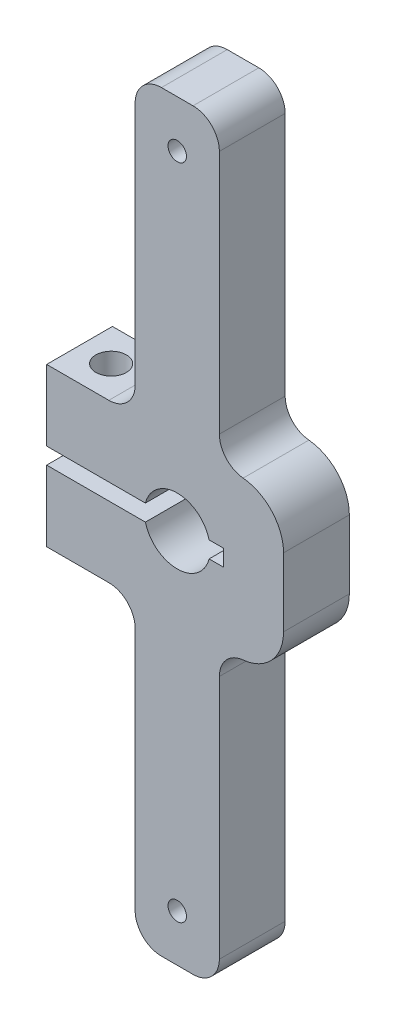
ISO-10303-21;
HEADER;
FILE_DESCRIPTION(('STEP AP214'),'2;1');
FILE_NAME('part.step','',(''),(''),'','','');
FILE_SCHEMA(('AUTOMOTIVE_DESIGN { 1 0 10303 214 1 1 1 1 }'));
ENDSEC;
DATA;
#1=APPLICATION_CONTEXT('core data for automotive mechanical design processes');
#2=APPLICATION_PROTOCOL_DEFINITION('international standard','automotive_design',2000,#1);
#3=PRODUCT_CONTEXT('',#1,'mechanical');
#4=PRODUCT('Part','Part','',(#3));
#5=PRODUCT_RELATED_PRODUCT_CATEGORY('part','',(#4));
#6=PRODUCT_DEFINITION_FORMATION('','',#4);
#7=PRODUCT_DEFINITION_CONTEXT('part definition',#1,'design');
#8=PRODUCT_DEFINITION('design','',#6,#7);
#9=PRODUCT_DEFINITION_SHAPE('','',#8);
#10=(LENGTH_UNIT() NAMED_UNIT(*) SI_UNIT(.MILLI.,.METRE.));
#11=(NAMED_UNIT(*) PLANE_ANGLE_UNIT() SI_UNIT($,.RADIAN.));
#12=(NAMED_UNIT(*) SI_UNIT($,.STERADIAN.) SOLID_ANGLE_UNIT());
#13=UNCERTAINTY_MEASURE_WITH_UNIT(LENGTH_MEASURE(1.E-05),#10,'distance_accuracy_value','');
#14=(GEOMETRIC_REPRESENTATION_CONTEXT(3) GLOBAL_UNCERTAINTY_ASSIGNED_CONTEXT((#13)) GLOBAL_UNIT_ASSIGNED_CONTEXT((#10,
#11,#12)) REPRESENTATION_CONTEXT('',''));
#15=CARTESIAN_POINT('',(0.,0.,0.));
#16=DIRECTION('',(0.,0.,1.));
#17=DIRECTION('',(1.,0.,0.));
#18=AXIS2_PLACEMENT_3D('',#15,#16,#17);
#19=CARTESIAN_POINT('',(-21.4924927341236,7.62,6.35));
#20=DIRECTION('',(0.,-1.,0.));
#21=DIRECTION('',(0.,0.,-1.));
#22=AXIS2_PLACEMENT_3D('',#19,#20,#21);
#23=PLANE('',#22);
#24=CARTESIAN_POINT('',(-18.4444927341236,7.62,3.175));
#25=DIRECTION('',(0.,-1.,0.));
#26=DIRECTION('',(0.,0.,-1.));
#27=AXIS2_PLACEMENT_3D('',#24,#25,#26);
#28=CIRCLE('',#27,1.4732);
#29=CARTESIAN_POINT('',(-18.4444927341236,7.62,1.7018));
#30=VERTEX_POINT('',#29);
#31=EDGE_CURVE('E402',#30,#30,#28,.T.);
#32=ORIENTED_EDGE('',*,*,#31,.T.);
#33=EDGE_LOOP('',(#32));
#34=FACE_BOUND('',#33,.T.);
#35=DIRECTION('',(-1.,0.,0.));
#36=VECTOR('',#35,1.);
#37=CARTESIAN_POINT('',(-6.25249273412365,7.62,6.35));
#38=LINE('',#37,#36);
#39=CARTESIAN_POINT('',(-15.494,7.62,6.35));
#40=VERTEX_POINT('',#39);
#41=CARTESIAN_POINT('',(-21.4924927341236,7.62,6.35));
#42=VERTEX_POINT('',#41);
#43=EDGE_CURVE('E336',#40,#42,#38,.T.);
#44=ORIENTED_EDGE('',*,*,#43,.F.);
#45=DIRECTION('',(0.,0.,1.));
#46=VECTOR('',#45,1.);
#47=CARTESIAN_POINT('',(-15.494,7.62,0.));
#48=LINE('',#47,#46);
#49=CARTESIAN_POINT('',(-15.494,7.62,0.));
#50=VERTEX_POINT('',#49);
#51=EDGE_CURVE('E454',#40,#50,#48,.F.);
#52=ORIENTED_EDGE('',*,*,#51,.T.);
#53=DIRECTION('',(-1.,0.,0.));
#54=VECTOR('',#53,1.);
#55=CARTESIAN_POINT('',(-21.4924927341236,7.62,0.));
#56=LINE('',#55,#54);
#57=CARTESIAN_POINT('',(-21.4924927341236,7.62,0.));
#58=VERTEX_POINT('',#57);
#59=EDGE_CURVE('E326',#50,#58,#56,.T.);
#60=ORIENTED_EDGE('',*,*,#59,.T.);
#61=DIRECTION('',(0.,0.,-1.));
#62=VECTOR('',#61,1.);
#63=CARTESIAN_POINT('',(-21.4924927341236,7.62,6.35));
#64=LINE('',#63,#62);
#65=EDGE_CURVE('E289',#42,#58,#64,.T.);
#66=ORIENTED_EDGE('',*,*,#65,.F.);
#67=EDGE_LOOP('',(#44,#52,#60,#66));
#68=FACE_BOUND('',#67,.T.);
#69=ADVANCED_FACE('F44',(#34,#68),#23,.F.);
#70=CARTESIAN_POINT('',(-4.445,-0.793749999999996,0.));
#71=DIRECTION('',(0.,-1.,0.));
#72=DIRECTION('',(1.,0.,0.));
#73=AXIS2_PLACEMENT_3D('',#70,#71,#72);
#74=PLANE('',#73);
#75=DIRECTION('',(1.,0.,0.));
#76=VECTOR('',#75,1.);
#77=CARTESIAN_POINT('',(-4.445,-0.793749999999996,0.));
#78=LINE('',#77,#76);
#79=CARTESIAN_POINT('',(-5.81581946894786,-0.793749999999997,0.));
#80=VERTEX_POINT('',#79);
#81=CARTESIAN_POINT('',(-4.445,-0.793749999999996,0.));
#82=VERTEX_POINT('',#81);
#83=EDGE_CURVE('E556',#80,#82,#78,.T.);
#84=ORIENTED_EDGE('',*,*,#83,.F.);
#85=DIRECTION('',(0.,0.,1.));
#86=VECTOR('',#85,1.);
#87=CARTESIAN_POINT('',(-5.81581946894786,-0.793749999999997,0.));
#88=LINE('',#87,#86);
#89=CARTESIAN_POINT('',(-5.81581946894786,-0.793749999999997,6.35));
#90=VERTEX_POINT('',#89);
#91=EDGE_CURVE('E546',#80,#90,#88,.T.);
#92=ORIENTED_EDGE('',*,*,#91,.T.);
#93=DIRECTION('',(1.,0.,0.));
#94=VECTOR('',#93,1.);
#95=CARTESIAN_POINT('',(-4.445,-0.793749999999996,6.35));
#96=LINE('',#95,#94);
#97=CARTESIAN_POINT('',(-4.445,-0.793749999999996,6.35));
#98=VERTEX_POINT('',#97);
#99=EDGE_CURVE('E308',#90,#98,#96,.T.);
#100=ORIENTED_EDGE('',*,*,#99,.T.);
#101=DIRECTION('',(0.,0.,1.));
#102=VECTOR('',#101,1.);
#103=CARTESIAN_POINT('',(-4.445,-0.793749999999996,0.));
#104=LINE('',#103,#102);
#105=EDGE_CURVE('E322',#82,#98,#104,.T.);
#106=ORIENTED_EDGE('',*,*,#105,.F.);
#107=EDGE_LOOP('',(#84,#92,#100,#106));
#108=FACE_BOUND('',#107,.T.);
#109=ADVANCED_FACE('F569',(#108),#74,.F.);
#110=CARTESIAN_POINT('',(-4.445,0.793750000000003,0.));
#111=DIRECTION('',(0.,1.,0.));
#112=DIRECTION('',(-1.,0.,0.));
#113=AXIS2_PLACEMENT_3D('',#110,#111,#112);
#114=PLANE('',#113);
#115=CARTESIAN_POINT('',(-18.4444927341236,0.793750000000001,3.175));
#116=DIRECTION('',(0.,1.,0.));
#117=DIRECTION('',(-1.,0.,0.));
#118=AXIS2_PLACEMENT_3D('',#115,#116,#117);
#119=CIRCLE('',#118,1.47319999999999);
#120=CARTESIAN_POINT('',(-19.9176927341236,0.793750000000001,3.175));
#121=VERTEX_POINT('',#120);
#122=EDGE_CURVE('E401',#121,#121,#119,.T.);
#123=ORIENTED_EDGE('',*,*,#122,.T.);
#124=EDGE_LOOP('',(#123));
#125=FACE_BOUND('',#124,.T.);
#126=DIRECTION('',(-1.,0.,0.));
#127=VECTOR('',#126,1.);
#128=CARTESIAN_POINT('',(-4.445,0.793750000000003,0.));
#129=LINE('',#128,#127);
#130=CARTESIAN_POINT('',(-11.9641805310521,0.793750000000002,0.));
#131=VERTEX_POINT('',#130);
#132=CARTESIAN_POINT('',(-21.4924927341236,0.79375,0.));
#133=VERTEX_POINT('',#132);
#134=EDGE_CURVE('E553',#131,#133,#129,.T.);
#135=ORIENTED_EDGE('',*,*,#134,.F.);
#136=DIRECTION('',(0.,0.,1.));
#137=VECTOR('',#136,1.);
#138=CARTESIAN_POINT('',(-11.9641805310521,0.793750000000002,0.));
#139=LINE('',#138,#137);
#140=CARTESIAN_POINT('',(-11.9641805310521,0.793750000000002,6.35));
#141=VERTEX_POINT('',#140);
#142=EDGE_CURVE('E288',#131,#141,#139,.T.);
#143=ORIENTED_EDGE('',*,*,#142,.T.);
#144=DIRECTION('',(-1.,0.,0.));
#145=VECTOR('',#144,1.);
#146=CARTESIAN_POINT('',(-4.445,0.793750000000003,6.35));
#147=LINE('',#146,#145);
#148=CARTESIAN_POINT('',(-21.4924927341236,0.793750000000001,6.35));
#149=VERTEX_POINT('',#148);
#150=EDGE_CURVE('E299',#141,#149,#147,.T.);
#151=ORIENTED_EDGE('',*,*,#150,.T.);
#152=DIRECTION('',(0.,0.,1.));
#153=VECTOR('',#152,1.);
#154=CARTESIAN_POINT('',(-21.4924927341236,0.793750000000001,0.));
#155=LINE('',#154,#153);
#156=EDGE_CURVE('E330',#133,#149,#155,.T.);
#157=ORIENTED_EDGE('',*,*,#156,.F.);
#158=EDGE_LOOP('',(#135,#143,#151,#157));
#159=FACE_BOUND('',#158,.T.);
#160=ADVANCED_FACE('F577',(#125,#159),#114,.F.);
#161=CARTESIAN_POINT('',(-21.4924927341236,-7.62,6.35));
#162=DIRECTION('',(1.,0.,0.));
#163=DIRECTION('',(0.,0.,-1.));
#164=AXIS2_PLACEMENT_3D('',#161,#162,#163);
#165=PLANE('',#164);
#166=DIRECTION('',(0.,-1.,0.));
#167=VECTOR('',#166,1.);
#168=CARTESIAN_POINT('',(-21.4924927341236,-7.62,6.35));
#169=LINE('',#168,#167);
#170=CARTESIAN_POINT('',(-21.4924927341236,-0.793750000000002,6.35));
#171=VERTEX_POINT('',#170);
#172=CARTESIAN_POINT('',(-21.4924927341236,-7.62,6.35));
#173=VERTEX_POINT('',#172);
#174=EDGE_CURVE('E339',#171,#173,#169,.T.);
#175=ORIENTED_EDGE('',*,*,#174,.F.);
#176=DIRECTION('',(0.,0.,1.));
#177=VECTOR('',#176,1.);
#178=CARTESIAN_POINT('',(-21.4924927341236,-0.793750000000002,0.));
#179=LINE('',#178,#177);
#180=CARTESIAN_POINT('',(-21.4924927341236,-0.793750000000002,0.));
#181=VERTEX_POINT('',#180);
#182=EDGE_CURVE('E327',#181,#171,#179,.T.);
#183=ORIENTED_EDGE('',*,*,#182,.F.);
#184=DIRECTION('',(0.,-1.,0.));
#185=VECTOR('',#184,1.);
#186=CARTESIAN_POINT('',(-21.4924927341236,-7.62,0.));
#187=LINE('',#186,#185);
#188=CARTESIAN_POINT('',(-21.4924927341236,-7.62,0.));
#189=VERTEX_POINT('',#188);
#190=EDGE_CURVE('E355',#181,#189,#187,.T.);
#191=ORIENTED_EDGE('',*,*,#190,.T.);
#192=DIRECTION('',(0.,0.,-1.));
#193=VECTOR('',#192,1.);
#194=CARTESIAN_POINT('',(-21.4924927341236,-7.62,6.35));
#195=LINE('',#194,#193);
#196=EDGE_CURVE('E352',#173,#189,#195,.T.);
#197=ORIENTED_EDGE('',*,*,#196,.F.);
#198=EDGE_LOOP('',(#175,#183,#191,#197));
#199=FACE_BOUND('',#198,.T.);
#200=ADVANCED_FACE('F601',(#199),#165,.F.);
#201=EDGE_CURVE('E356',#58,#133,#187,.T.);
#202=ORIENTED_EDGE('',*,*,#201,.T.);
#203=ORIENTED_EDGE('',*,*,#156,.T.);
#204=EDGE_CURVE('E341',#42,#149,#169,.T.);
#205=ORIENTED_EDGE('',*,*,#204,.F.);
#206=ORIENTED_EDGE('',*,*,#65,.T.);
#207=EDGE_LOOP('',(#202,#203,#205,#206));
#208=FACE_BOUND('',#207,.T.);
#209=ADVANCED_FACE('F644',(#208),#165,.F.);
#210=CARTESIAN_POINT('',(-6.25249273412365,-7.62,6.35));
#211=DIRECTION('',(0.,1.,0.));
#212=DIRECTION('',(0.,0.,1.));
#213=AXIS2_PLACEMENT_3D('',#210,#211,#212);
#214=PLANE('',#213);
#215=CARTESIAN_POINT('',(-18.4444927341236,-7.62,3.175));
#216=DIRECTION('',(0.,-1.,0.));
#217=DIRECTION('',(0.,0.,-1.));
#218=AXIS2_PLACEMENT_3D('',#215,#216,#217);
#219=CIRCLE('',#218,1.47319999999999);
#220=CARTESIAN_POINT('',(-18.4444927341236,-7.62,1.70180000000001));
#221=VERTEX_POINT('',#220);
#222=EDGE_CURVE('E530',#221,#221,#219,.T.);
#223=ORIENTED_EDGE('',*,*,#222,.F.);
#224=EDGE_LOOP('',(#223));
#225=FACE_BOUND('',#224,.T.);
#226=DIRECTION('',(1.,0.,0.));
#227=VECTOR('',#226,1.);
#228=CARTESIAN_POINT('',(-6.25249273412365,-7.62,0.));
#229=LINE('',#228,#227);
#230=CARTESIAN_POINT('',(-15.494,-7.62,0.));
#231=VERTEX_POINT('',#230);
#232=EDGE_CURVE('E360',#189,#231,#229,.T.);
#233=ORIENTED_EDGE('',*,*,#232,.T.);
#234=DIRECTION('',(0.,0.,1.));
#235=VECTOR('',#234,1.);
#236=CARTESIAN_POINT('',(-15.494,-7.62,6.35));
#237=LINE('',#236,#235);
#238=CARTESIAN_POINT('',(-15.494,-7.62,6.35));
#239=VERTEX_POINT('',#238);
#240=EDGE_CURVE('E433',#231,#239,#237,.T.);
#241=ORIENTED_EDGE('',*,*,#240,.T.);
#242=DIRECTION('',(1.,0.,0.));
#243=VECTOR('',#242,1.);
#244=CARTESIAN_POINT('',(-21.4924927341236,-7.62,6.35));
#245=LINE('',#244,#243);
#246=EDGE_CURVE('E344',#173,#239,#245,.T.);
#247=ORIENTED_EDGE('',*,*,#246,.F.);
#248=ORIENTED_EDGE('',*,*,#196,.T.);
#249=EDGE_LOOP('',(#233,#241,#247,#248));
#250=FACE_BOUND('',#249,.T.);
#251=ADVANCED_FACE('F609',(#225,#250),#214,.F.);
#252=CARTESIAN_POINT('',(1.36750726587635,7.62,6.35));
#253=DIRECTION('',(-1.,0.,0.));
#254=DIRECTION('',(0.,-1.,0.));
#255=AXIS2_PLACEMENT_3D('',#252,#253,#254);
#256=PLANE('',#255);
#257=DIRECTION('',(0.,1.,0.));
#258=VECTOR('',#257,1.);
#259=CARTESIAN_POINT('',(1.36750726587635,0.,6.35));
#260=LINE('',#259,#258);
#261=CARTESIAN_POINT('',(1.36750726587635,-3.302,6.35));
#262=VERTEX_POINT('',#261);
#263=CARTESIAN_POINT('',(1.36750726587635,3.302,6.35));
#264=VERTEX_POINT('',#263);
#265=EDGE_CURVE('E348',#262,#264,#260,.T.);
#266=ORIENTED_EDGE('',*,*,#265,.F.);
#267=DIRECTION('',(0.,0.,-1.));
#268=VECTOR('',#267,1.);
#269=CARTESIAN_POINT('',(1.36750726587635,-3.302,6.35));
#270=LINE('',#269,#268);
#271=CARTESIAN_POINT('',(1.36750726587635,-3.302,0.));
#272=VERTEX_POINT('',#271);
#273=EDGE_CURVE('E378',#262,#272,#270,.T.);
#274=ORIENTED_EDGE('',*,*,#273,.T.);
#275=DIRECTION('',(0.,1.,0.));
#276=VECTOR('',#275,1.);
#277=CARTESIAN_POINT('',(1.36750726587635,7.62,0.));
#278=LINE('',#277,#276);
#279=CARTESIAN_POINT('',(1.36750726587635,3.302,0.));
#280=VERTEX_POINT('',#279);
#281=EDGE_CURVE('E340',#272,#280,#278,.T.);
#282=ORIENTED_EDGE('',*,*,#281,.T.);
#283=DIRECTION('',(0.,0.,-1.));
#284=VECTOR('',#283,1.);
#285=CARTESIAN_POINT('',(1.36750726587635,3.302,6.35));
#286=LINE('',#285,#284);
#287=EDGE_CURVE('E375',#280,#264,#286,.F.);
#288=ORIENTED_EDGE('',*,*,#287,.T.);
#289=EDGE_LOOP('',(#266,#274,#282,#288));
#290=FACE_BOUND('',#289,.T.);
#291=ADVANCED_FACE('F711',(#290),#256,.F.);
#292=CARTESIAN_POINT('',(1.36750726587635,7.62,6.35));
#293=DIRECTION('',(0.,0.,-1.));
#294=DIRECTION('',(-1.,0.,0.));
#295=AXIS2_PLACEMENT_3D('',#292,#293,#294);
#296=PLANE('',#295);
#297=CARTESIAN_POINT('',(-8.89,-31.75,6.35));
#298=DIRECTION('',(0.,0.,-1.));
#299=DIRECTION('',(-1.,0.,0.));
#300=AXIS2_PLACEMENT_3D('',#297,#298,#299);
#301=CIRCLE('',#300,0.888999999999997);
#302=CARTESIAN_POINT('',(-9.77899999999999,-31.75,6.35));
#303=VERTEX_POINT('',#302);
#304=EDGE_CURVE('E583',#303,#303,#301,.T.);
#305=ORIENTED_EDGE('',*,*,#304,.T.);
#306=EDGE_LOOP('',(#305));
#307=FACE_BOUND('',#306,.T.);
#308=CARTESIAN_POINT('',(-8.89,31.75,6.35));
#309=DIRECTION('',(0.,0.,-1.));
#310=DIRECTION('',(-1.,0.,0.));
#311=AXIS2_PLACEMENT_3D('',#308,#309,#310);
#312=CIRCLE('',#311,0.888999999999997);
#313=CARTESIAN_POINT('',(-9.77899999999999,31.75,6.35));
#314=VERTEX_POINT('',#313);
#315=EDGE_CURVE('E507',#314,#314,#312,.T.);
#316=ORIENTED_EDGE('',*,*,#315,.T.);
#317=EDGE_LOOP('',(#316));
#318=FACE_BOUND('',#317,.T.);
#319=DIRECTION('',(0.,1.,0.));
#320=VECTOR('',#319,1.);
#321=CARTESIAN_POINT('',(-12.954,-36.2966,6.35));
#322=LINE('',#321,#320);
#323=CARTESIAN_POINT('',(-12.954,-33.7566,6.35));
#324=VERTEX_POINT('',#323);
#325=CARTESIAN_POINT('',(-12.954,-10.16,6.35));
#326=VERTEX_POINT('',#325);
#327=EDGE_CURVE('E493',#324,#326,#322,.T.);
#328=ORIENTED_EDGE('',*,*,#327,.F.);
#329=CARTESIAN_POINT('',(-10.414,-33.7566,6.35));
#330=DIRECTION('',(0.,0.,-1.));
#331=DIRECTION('',(-1.,0.,0.));
#332=AXIS2_PLACEMENT_3D('',#329,#330,#331);
#333=CIRCLE('',#332,2.54);
#334=CARTESIAN_POINT('',(-10.414,-36.2966,6.35));
#335=VERTEX_POINT('',#334);
#336=EDGE_CURVE('E417',#324,#335,#333,.F.);
#337=ORIENTED_EDGE('',*,*,#336,.T.);
#338=DIRECTION('',(1.,0.,0.));
#339=VECTOR('',#338,1.);
#340=CARTESIAN_POINT('',(-4.82599999999999,-36.2966,6.35));
#341=LINE('',#340,#339);
#342=CARTESIAN_POINT('',(-7.366,-36.2966,6.35));
#343=VERTEX_POINT('',#342);
#344=EDGE_CURVE('E588',#335,#343,#341,.T.);
#345=ORIENTED_EDGE('',*,*,#344,.T.);
#346=CARTESIAN_POINT('',(-7.366,-33.7566,6.35));
#347=DIRECTION('',(0.,0.,-1.));
#348=DIRECTION('',(-1.,0.,0.));
#349=AXIS2_PLACEMENT_3D('',#346,#347,#348);
#350=CIRCLE('',#349,2.54);
#351=CARTESIAN_POINT('',(-4.82599999999999,-33.7566,6.35));
#352=VERTEX_POINT('',#351);
#353=EDGE_CURVE('E415',#343,#352,#350,.F.);
#354=ORIENTED_EDGE('',*,*,#353,.T.);
#355=DIRECTION('',(0.,1.,0.));
#356=VECTOR('',#355,1.);
#357=CARTESIAN_POINT('',(-4.82599999999999,-36.2966,6.35));
#358=LINE('',#357,#356);
#359=CARTESIAN_POINT('',(-4.82599999999999,-10.1277317121534,6.35));
#360=VERTEX_POINT('',#359);
#361=EDGE_CURVE('E617',#352,#360,#358,.T.);
#362=ORIENTED_EDGE('',*,*,#361,.T.);
#363=CARTESIAN_POINT('',(-2.28599999999999,-10.1277317121534,6.35));
#364=DIRECTION('',(0.,0.,-1.));
#365=DIRECTION('',(-1.,0.,0.));
#366=AXIS2_PLACEMENT_3D('',#363,#364,#365);
#367=CIRCLE('',#366,2.54);
#368=CARTESIAN_POINT('',(-2.53210842004579,-7.59968292987438,6.35));
#369=VERTEX_POINT('',#368);
#370=EDGE_CURVE('E483',#360,#369,#367,.T.);
#371=ORIENTED_EDGE('',*,*,#370,.T.);
#372=CARTESIAN_POINT('',(-2.95049273412365,-3.302,6.35));
#373=DIRECTION('',(0.,0.,-1.));
#374=DIRECTION('',(-1.,0.,0.));
#375=AXIS2_PLACEMENT_3D('',#372,#373,#374);
#376=CIRCLE('',#375,4.318);
#377=EDGE_CURVE('E393',#369,#262,#376,.F.);
#378=ORIENTED_EDGE('',*,*,#377,.T.);
#379=ORIENTED_EDGE('',*,*,#265,.T.);
#380=CARTESIAN_POINT('',(-2.95049273412365,3.302,6.35));
#381=DIRECTION('',(0.,0.,-1.));
#382=DIRECTION('',(-1.,0.,0.));
#383=AXIS2_PLACEMENT_3D('',#380,#381,#382);
#384=CIRCLE('',#383,4.318);
#385=CARTESIAN_POINT('',(-2.53210842004579,7.59968292987438,6.35));
#386=VERTEX_POINT('',#385);
#387=EDGE_CURVE('E389',#264,#386,#384,.F.);
#388=ORIENTED_EDGE('',*,*,#387,.T.);
#389=CARTESIAN_POINT('',(-2.28599999999999,10.1277317121534,6.35));
#390=DIRECTION('',(0.,0.,-1.));
#391=DIRECTION('',(-1.,0.,0.));
#392=AXIS2_PLACEMENT_3D('',#389,#390,#391);
#393=CIRCLE('',#392,2.54);
#394=CARTESIAN_POINT('',(-4.82599999999999,10.1277317121534,6.35));
#395=VERTEX_POINT('',#394);
#396=EDGE_CURVE('E11',#386,#395,#393,.T.);
#397=ORIENTED_EDGE('',*,*,#396,.T.);
#398=DIRECTION('',(0.,-1.,0.));
#399=VECTOR('',#398,1.);
#400=CARTESIAN_POINT('',(-4.82599999999999,36.2966,6.35));
#401=LINE('',#400,#399);
#402=CARTESIAN_POINT('',(-4.82599999999999,33.7566,6.35));
#403=VERTEX_POINT('',#402);
#404=EDGE_CURVE('E497',#403,#395,#401,.T.);
#405=ORIENTED_EDGE('',*,*,#404,.F.);
#406=CARTESIAN_POINT('',(-7.366,33.7566,6.35));
#407=DIRECTION('',(0.,0.,-1.));
#408=DIRECTION('',(-1.,0.,0.));
#409=AXIS2_PLACEMENT_3D('',#406,#407,#408);
#410=CIRCLE('',#409,2.54);
#411=CARTESIAN_POINT('',(-7.366,36.2966,6.35));
#412=VERTEX_POINT('',#411);
#413=EDGE_CURVE('E409',#403,#412,#410,.F.);
#414=ORIENTED_EDGE('',*,*,#413,.T.);
#415=DIRECTION('',(1.,0.,0.));
#416=VECTOR('',#415,1.);
#417=CARTESIAN_POINT('',(-4.82599999999999,36.2966,6.35));
#418=LINE('',#417,#416);
#419=CARTESIAN_POINT('',(-10.414,36.2966,6.35));
#420=VERTEX_POINT('',#419);
#421=EDGE_CURVE('E498',#420,#412,#418,.T.);
#422=ORIENTED_EDGE('',*,*,#421,.F.);
#423=CARTESIAN_POINT('',(-10.414,33.7566,6.35));
#424=DIRECTION('',(0.,0.,-1.));
#425=DIRECTION('',(-1.,0.,0.));
#426=AXIS2_PLACEMENT_3D('',#423,#424,#425);
#427=CIRCLE('',#426,2.54);
#428=CARTESIAN_POINT('',(-12.954,33.7566,6.35));
#429=VERTEX_POINT('',#428);
#430=EDGE_CURVE('E412',#420,#429,#427,.F.);
#431=ORIENTED_EDGE('',*,*,#430,.T.);
#432=DIRECTION('',(0.,-1.,0.));
#433=VECTOR('',#432,1.);
#434=CARTESIAN_POINT('',(-12.954,36.2966,6.35));
#435=LINE('',#434,#433);
#436=CARTESIAN_POINT('',(-12.954,10.16,6.35));
#437=VERTEX_POINT('',#436);
#438=EDGE_CURVE('E500',#429,#437,#435,.T.);
#439=ORIENTED_EDGE('',*,*,#438,.T.);
#440=CARTESIAN_POINT('',(-15.494,10.16,6.35));
#441=DIRECTION('',(0.,0.,-1.));
#442=DIRECTION('',(-1.,0.,0.));
#443=AXIS2_PLACEMENT_3D('',#440,#441,#442);
#444=CIRCLE('',#443,2.54);
#445=EDGE_CURVE('E486',#437,#40,#444,.T.);
#446=ORIENTED_EDGE('',*,*,#445,.T.);
#447=ORIENTED_EDGE('',*,*,#43,.T.);
#448=ORIENTED_EDGE('',*,*,#204,.T.);
#449=ORIENTED_EDGE('',*,*,#150,.F.);
#450=CARTESIAN_POINT('',(-8.89,0.,6.35));
#451=DIRECTION('',(0.,0.,1.));
#452=DIRECTION('',(1.,0.,0.));
#453=AXIS2_PLACEMENT_3D('',#450,#451,#452);
#454=CIRCLE('',#453,3.175);
#455=CARTESIAN_POINT('',(-5.81581946894786,0.793750000000003,6.35));
#456=VERTEX_POINT('',#455);
#457=EDGE_CURVE('E279',#456,#141,#454,.T.);
#458=ORIENTED_EDGE('',*,*,#457,.F.);
#459=CARTESIAN_POINT('',(-4.445,0.793750000000003,6.35));
#460=VERTEX_POINT('',#459);
#461=EDGE_CURVE('E297',#460,#456,#147,.T.);
#462=ORIENTED_EDGE('',*,*,#461,.F.);
#463=DIRECTION('',(0.,1.,0.));
#464=VECTOR('',#463,1.);
#465=CARTESIAN_POINT('',(-4.445,-0.793749999999996,6.35));
#466=LINE('',#465,#464);
#467=EDGE_CURVE('E315',#98,#460,#466,.T.);
#468=ORIENTED_EDGE('',*,*,#467,.F.);
#469=ORIENTED_EDGE('',*,*,#99,.F.);
#470=CARTESIAN_POINT('',(-11.9641805310521,-0.793749999999999,6.35));
#471=VERTEX_POINT('',#470);
#472=EDGE_CURVE('E302',#471,#90,#454,.T.);
#473=ORIENTED_EDGE('',*,*,#472,.F.);
#474=EDGE_CURVE('E312',#171,#471,#96,.T.);
#475=ORIENTED_EDGE('',*,*,#474,.F.);
#476=ORIENTED_EDGE('',*,*,#174,.T.);
#477=ORIENTED_EDGE('',*,*,#246,.T.);
#478=CARTESIAN_POINT('',(-15.494,-10.16,6.35));
#479=DIRECTION('',(0.,0.,-1.));
#480=DIRECTION('',(-1.,0.,0.));
#481=AXIS2_PLACEMENT_3D('',#478,#479,#480);
#482=CIRCLE('',#481,2.54);
#483=EDGE_CURVE('E474',#239,#326,#482,.T.);
#484=ORIENTED_EDGE('',*,*,#483,.T.);
#485=EDGE_LOOP('',(#328,#337,#345,#354,#362,#371,#378,#379,#388,#397,#405,#414,#422,#431,#439,
#446,#447,#448,#449,#458,#462,#468,#469,#473,#475,#476,#477,#484));
#486=FACE_BOUND('',#485,.T.);
#487=ADVANCED_FACE('F295',(#307,#318,#486),#296,.F.);
#488=CARTESIAN_POINT('',(1.36750726587635,7.62,0.));
#489=DIRECTION('',(0.,0.,-1.));
#490=DIRECTION('',(-1.,0.,0.));
#491=AXIS2_PLACEMENT_3D('',#488,#489,#490);
#492=PLANE('',#491);
#493=CARTESIAN_POINT('',(-8.89,-31.75,0.));
#494=DIRECTION('',(0.,0.,-1.));
#495=DIRECTION('',(-1.,0.,0.));
#496=AXIS2_PLACEMENT_3D('',#493,#494,#495);
#497=CIRCLE('',#496,0.888999999999999);
#498=CARTESIAN_POINT('',(-9.77899999999999,-31.75,0.));
#499=VERTEX_POINT('',#498);
#500=EDGE_CURVE('E581',#499,#499,#497,.T.);
#501=ORIENTED_EDGE('',*,*,#500,.F.);
#502=EDGE_LOOP('',(#501));
#503=FACE_BOUND('',#502,.T.);
#504=CARTESIAN_POINT('',(-8.89,31.75,0.));
#505=DIRECTION('',(0.,0.,-1.));
#506=DIRECTION('',(-1.,0.,0.));
#507=AXIS2_PLACEMENT_3D('',#504,#505,#506);
#508=CIRCLE('',#507,0.888999999999999);
#509=CARTESIAN_POINT('',(-9.77899999999999,31.75,0.));
#510=VERTEX_POINT('',#509);
#511=EDGE_CURVE('E505',#510,#510,#508,.T.);
#512=ORIENTED_EDGE('',*,*,#511,.F.);
#513=EDGE_LOOP('',(#512));
#514=FACE_BOUND('',#513,.T.);
#515=DIRECTION('',(-1.,0.,0.));
#516=VECTOR('',#515,1.);
#517=CARTESIAN_POINT('',(-12.954,-36.2966,0.));
#518=LINE('',#517,#516);
#519=CARTESIAN_POINT('',(-7.366,-36.2966,0.));
#520=VERTEX_POINT('',#519);
#521=CARTESIAN_POINT('',(-10.414,-36.2966,0.));
#522=VERTEX_POINT('',#521);
#523=EDGE_CURVE('E998',#520,#522,#518,.T.);
#524=ORIENTED_EDGE('',*,*,#523,.T.);
#525=CARTESIAN_POINT('',(-10.414,-33.7566,0.));
#526=DIRECTION('',(0.,0.,-1.));
#527=DIRECTION('',(-1.,0.,0.));
#528=AXIS2_PLACEMENT_3D('',#525,#526,#527);
#529=CIRCLE('',#528,2.54);
#530=CARTESIAN_POINT('',(-12.954,-33.7566,0.));
#531=VERTEX_POINT('',#530);
#532=EDGE_CURVE('E431',#522,#531,#529,.T.);
#533=ORIENTED_EDGE('',*,*,#532,.T.);
#534=DIRECTION('',(0.,1.,0.));
#535=VECTOR('',#534,1.);
#536=CARTESIAN_POINT('',(-12.954,-36.2966,0.));
#537=LINE('',#536,#535);
#538=CARTESIAN_POINT('',(-12.954,-10.16,0.));
#539=VERTEX_POINT('',#538);
#540=EDGE_CURVE('E586',#531,#539,#537,.T.);
#541=ORIENTED_EDGE('',*,*,#540,.T.);
#542=CARTESIAN_POINT('',(-15.494,-10.16,0.));
#543=DIRECTION('',(0.,0.,-1.));
#544=DIRECTION('',(-1.,0.,0.));
#545=AXIS2_PLACEMENT_3D('',#542,#543,#544);
#546=CIRCLE('',#545,2.54);
#547=EDGE_CURVE('E477',#539,#231,#546,.F.);
#548=ORIENTED_EDGE('',*,*,#547,.T.);
#549=ORIENTED_EDGE('',*,*,#232,.F.);
#550=ORIENTED_EDGE('',*,*,#190,.F.);
#551=CARTESIAN_POINT('',(-11.9641805310521,-0.793749999999999,0.));
#552=VERTEX_POINT('',#551);
#553=EDGE_CURVE('E335',#181,#552,#78,.T.);
#554=ORIENTED_EDGE('',*,*,#553,.T.);
#555=CARTESIAN_POINT('',(-8.89,0.,0.));
#556=DIRECTION('',(0.,0.,1.));
#557=DIRECTION('',(1.,0.,0.));
#558=AXIS2_PLACEMENT_3D('',#555,#556,#557);
#559=CIRCLE('',#558,3.175);
#560=EDGE_CURVE('E301',#552,#80,#559,.T.);
#561=ORIENTED_EDGE('',*,*,#560,.T.);
#562=ORIENTED_EDGE('',*,*,#83,.T.);
#563=DIRECTION('',(0.,1.,0.));
#564=VECTOR('',#563,1.);
#565=CARTESIAN_POINT('',(-4.445,-0.793749999999996,0.));
#566=LINE('',#565,#564);
#567=CARTESIAN_POINT('',(-4.445,0.793750000000003,0.));
#568=VERTEX_POINT('',#567);
#569=EDGE_CURVE('E321',#82,#568,#566,.T.);
#570=ORIENTED_EDGE('',*,*,#569,.T.);
#571=CARTESIAN_POINT('',(-5.81581946894786,0.793750000000003,0.));
#572=VERTEX_POINT('',#571);
#573=EDGE_CURVE('E554',#568,#572,#129,.T.);
#574=ORIENTED_EDGE('',*,*,#573,.T.);
#575=EDGE_CURVE('E282',#572,#131,#559,.T.);
#576=ORIENTED_EDGE('',*,*,#575,.T.);
#577=ORIENTED_EDGE('',*,*,#134,.T.);
#578=ORIENTED_EDGE('',*,*,#201,.F.);
#579=ORIENTED_EDGE('',*,*,#59,.F.);
#580=CARTESIAN_POINT('',(-15.494,10.16,0.));
#581=DIRECTION('',(0.,0.,-1.));
#582=DIRECTION('',(-1.,0.,0.));
#583=AXIS2_PLACEMENT_3D('',#580,#581,#582);
#584=CIRCLE('',#583,2.54);
#585=CARTESIAN_POINT('',(-12.954,10.16,0.));
#586=VERTEX_POINT('',#585);
#587=EDGE_CURVE('E489',#50,#586,#584,.F.);
#588=ORIENTED_EDGE('',*,*,#587,.T.);
#589=DIRECTION('',(0.,-1.,0.));
#590=VECTOR('',#589,1.);
#591=CARTESIAN_POINT('',(-12.954,36.2966,0.));
#592=LINE('',#591,#590);
#593=CARTESIAN_POINT('',(-12.954,33.7566,0.));
#594=VERTEX_POINT('',#593);
#595=EDGE_CURVE('E502',#594,#586,#592,.T.);
#596=ORIENTED_EDGE('',*,*,#595,.F.);
#597=CARTESIAN_POINT('',(-10.414,33.7566,0.));
#598=DIRECTION('',(0.,0.,-1.));
#599=DIRECTION('',(-1.,0.,0.));
#600=AXIS2_PLACEMENT_3D('',#597,#598,#599);
#601=CIRCLE('',#600,2.54);
#602=CARTESIAN_POINT('',(-10.414,36.2966,0.));
#603=VERTEX_POINT('',#602);
#604=EDGE_CURVE('E426',#594,#603,#601,.T.);
#605=ORIENTED_EDGE('',*,*,#604,.T.);
#606=DIRECTION('',(-1.,0.,0.));
#607=VECTOR('',#606,1.);
#608=CARTESIAN_POINT('',(-12.954,36.2966,0.));
#609=LINE('',#608,#607);
#610=CARTESIAN_POINT('',(-7.366,36.2966,0.));
#611=VERTEX_POINT('',#610);
#612=EDGE_CURVE('E511',#611,#603,#609,.T.);
#613=ORIENTED_EDGE('',*,*,#612,.F.);
#614=CARTESIAN_POINT('',(-7.366,33.7566,0.));
#615=DIRECTION('',(0.,0.,-1.));
#616=DIRECTION('',(-1.,0.,0.));
#617=AXIS2_PLACEMENT_3D('',#614,#615,#616);
#618=CIRCLE('',#617,2.54);
#619=CARTESIAN_POINT('',(-4.826,33.7566,0.));
#620=VERTEX_POINT('',#619);
#621=EDGE_CURVE('E423',#611,#620,#618,.T.);
#622=ORIENTED_EDGE('',*,*,#621,.T.);
#623=DIRECTION('',(0.,-1.,0.));
#624=VECTOR('',#623,1.);
#625=CARTESIAN_POINT('',(-4.826,36.2966,0.));
#626=LINE('',#625,#624);
#627=CARTESIAN_POINT('',(-4.826,10.1277317121534,0.));
#628=VERTEX_POINT('',#627);
#629=EDGE_CURVE('E495',#620,#628,#626,.T.);
#630=ORIENTED_EDGE('',*,*,#629,.T.);
#631=CARTESIAN_POINT('',(-2.28599999999999,10.1277317121534,0.));
#632=DIRECTION('',(0.,0.,-1.));
#633=DIRECTION('',(-1.,0.,0.));
#634=AXIS2_PLACEMENT_3D('',#631,#632,#633);
#635=CIRCLE('',#634,2.54);
#636=CARTESIAN_POINT('',(-2.53210842004579,7.59968292987438,0.));
#637=VERTEX_POINT('',#636);
#638=EDGE_CURVE('E53',#628,#637,#635,.F.);
#639=ORIENTED_EDGE('',*,*,#638,.T.);
#640=CARTESIAN_POINT('',(-2.95049273412365,3.302,0.));
#641=DIRECTION('',(0.,0.,-1.));
#642=DIRECTION('',(-1.,0.,0.));
#643=AXIS2_PLACEMENT_3D('',#640,#641,#642);
#644=CIRCLE('',#643,4.318);
#645=EDGE_CURVE('E382',#637,#280,#644,.T.);
#646=ORIENTED_EDGE('',*,*,#645,.T.);
#647=ORIENTED_EDGE('',*,*,#281,.F.);
#648=CARTESIAN_POINT('',(-2.95049273412365,-3.302,0.));
#649=DIRECTION('',(0.,0.,-1.));
#650=DIRECTION('',(-1.,0.,0.));
#651=AXIS2_PLACEMENT_3D('',#648,#649,#650);
#652=CIRCLE('',#651,4.318);
#653=CARTESIAN_POINT('',(-2.53210842004579,-7.59968292987438,0.));
#654=VERTEX_POINT('',#653);
#655=EDGE_CURVE('E385',#272,#654,#652,.T.);
#656=ORIENTED_EDGE('',*,*,#655,.T.);
#657=CARTESIAN_POINT('',(-2.28599999999999,-10.1277317121534,0.));
#658=DIRECTION('',(0.,0.,-1.));
#659=DIRECTION('',(-1.,0.,0.));
#660=AXIS2_PLACEMENT_3D('',#657,#658,#659);
#661=CIRCLE('',#660,2.54);
#662=CARTESIAN_POINT('',(-4.826,-10.1277317121534,0.));
#663=VERTEX_POINT('',#662);
#664=EDGE_CURVE('E480',#654,#663,#661,.F.);
#665=ORIENTED_EDGE('',*,*,#664,.T.);
#666=DIRECTION('',(0.,1.,0.));
#667=VECTOR('',#666,1.);
#668=CARTESIAN_POINT('',(-4.826,-36.2966,0.));
#669=LINE('',#668,#667);
#670=CARTESIAN_POINT('',(-4.826,-33.7566,0.));
#671=VERTEX_POINT('',#670);
#672=EDGE_CURVE('E508',#671,#663,#669,.T.);
#673=ORIENTED_EDGE('',*,*,#672,.F.);
#674=CARTESIAN_POINT('',(-7.366,-33.7566,0.));
#675=DIRECTION('',(0.,0.,-1.));
#676=DIRECTION('',(-1.,0.,0.));
#677=AXIS2_PLACEMENT_3D('',#674,#675,#676);
#678=CIRCLE('',#677,2.54);
#679=EDGE_CURVE('E429',#671,#520,#678,.T.);
#680=ORIENTED_EDGE('',*,*,#679,.T.);
#681=EDGE_LOOP('',(#524,#533,#541,#548,#549,#550,#554,#561,#562,#570,#574,#576,#577,#578,#579,
#588,#596,#605,#613,#622,#630,#639,#646,#647,#656,#665,#673,#680));
#682=FACE_BOUND('',#681,.T.);
#683=ADVANCED_FACE('F566',(#503,#514,#682),#492,.T.);
#684=CARTESIAN_POINT('',(-4.445,-0.793749999999996,0.));
#685=DIRECTION('',(1.,0.,0.));
#686=DIRECTION('',(0.,0.,-1.));
#687=AXIS2_PLACEMENT_3D('',#684,#685,#686);
#688=PLANE('',#687);
#689=ORIENTED_EDGE('',*,*,#467,.T.);
#690=DIRECTION('',(0.,0.,1.));
#691=VECTOR('',#690,1.);
#692=CARTESIAN_POINT('',(-4.445,0.793750000000003,0.));
#693=LINE('',#692,#691);
#694=EDGE_CURVE('E305',#568,#460,#693,.T.);
#695=ORIENTED_EDGE('',*,*,#694,.F.);
#696=ORIENTED_EDGE('',*,*,#569,.F.);
#697=ORIENTED_EDGE('',*,*,#105,.T.);
#698=EDGE_LOOP('',(#689,#695,#696,#697));
#699=FACE_BOUND('',#698,.T.);
#700=ADVANCED_FACE('F572',(#699),#688,.F.);
#701=CARTESIAN_POINT('',(-18.4444927341236,-0.793750000000001,3.175));
#702=DIRECTION('',(0.,-1.,0.));
#703=DIRECTION('',(1.,0.,0.));
#704=AXIS2_PLACEMENT_3D('',#701,#702,#703);
#705=CIRCLE('',#704,1.47319999999999);
#706=CARTESIAN_POINT('',(-16.9712927341237,-0.79375,3.175));
#707=VERTEX_POINT('',#706);
#708=EDGE_CURVE('E397',#707,#707,#705,.T.);
#709=ORIENTED_EDGE('',*,*,#708,.T.);
#710=EDGE_LOOP('',(#709));
#711=FACE_BOUND('',#710,.T.);
#712=ORIENTED_EDGE('',*,*,#474,.T.);
#713=DIRECTION('',(0.,0.,1.));
#714=VECTOR('',#713,1.);
#715=CARTESIAN_POINT('',(-11.9641805310521,-0.793749999999999,0.));
#716=LINE('',#715,#714);
#717=EDGE_CURVE('E541',#471,#552,#716,.F.);
#718=ORIENTED_EDGE('',*,*,#717,.T.);
#719=ORIENTED_EDGE('',*,*,#553,.F.);
#720=ORIENTED_EDGE('',*,*,#182,.T.);
#721=EDGE_LOOP('',(#712,#718,#719,#720));
#722=FACE_BOUND('',#721,.T.);
#723=ADVANCED_FACE('F598',(#711,#722),#74,.F.);
#724=ORIENTED_EDGE('',*,*,#461,.T.);
#725=DIRECTION('',(0.,0.,1.));
#726=VECTOR('',#725,1.);
#727=CARTESIAN_POINT('',(-5.81581946894786,0.793750000000003,0.));
#728=LINE('',#727,#726);
#729=EDGE_CURVE('E276',#456,#572,#728,.F.);
#730=ORIENTED_EDGE('',*,*,#729,.T.);
#731=ORIENTED_EDGE('',*,*,#573,.F.);
#732=ORIENTED_EDGE('',*,*,#694,.T.);
#733=EDGE_LOOP('',(#724,#730,#731,#732));
#734=FACE_BOUND('',#733,.T.);
#735=ADVANCED_FACE('F304',(#734),#114,.F.);
#736=CARTESIAN_POINT('',(-8.89,0.,0.));
#737=DIRECTION('',(0.,0.,1.));
#738=DIRECTION('',(1.,0.,0.));
#739=AXIS2_PLACEMENT_3D('',#736,#737,#738);
#740=CYLINDRICAL_SURFACE('',#739,3.175);
#741=ORIENTED_EDGE('',*,*,#575,.F.);
#742=ORIENTED_EDGE('',*,*,#729,.F.);
#743=ORIENTED_EDGE('',*,*,#457,.T.);
#744=ORIENTED_EDGE('',*,*,#142,.F.);
#745=EDGE_LOOP('',(#741,#742,#743,#744));
#746=FACE_BOUND('',#745,.T.);
#747=ADVANCED_FACE('F278',(#746),#740,.F.);
#748=ORIENTED_EDGE('',*,*,#560,.F.);
#749=ORIENTED_EDGE('',*,*,#717,.F.);
#750=ORIENTED_EDGE('',*,*,#472,.T.);
#751=ORIENTED_EDGE('',*,*,#91,.F.);
#752=EDGE_LOOP('',(#748,#749,#750,#751));
#753=FACE_BOUND('',#752,.T.);
#754=ADVANCED_FACE('F594',(#753),#740,.F.);
#755=CARTESIAN_POINT('',(-2.95049273412365,-3.302,6.35));
#756=DIRECTION('',(0.,0.,-1.));
#757=DIRECTION('',(-1.,0.,0.));
#758=AXIS2_PLACEMENT_3D('',#755,#756,#757);
#759=CYLINDRICAL_SURFACE('',#758,4.318);
#760=ORIENTED_EDGE('',*,*,#377,.F.);
#761=DIRECTION('',(0.,0.,-1.));
#762=VECTOR('',#761,1.);
#763=CARTESIAN_POINT('',(-2.53210842004579,-7.59968292987438,6.35));
#764=LINE('',#763,#762);
#765=EDGE_CURVE('E437',#369,#654,#764,.T.);
#766=ORIENTED_EDGE('',*,*,#765,.T.);
#767=ORIENTED_EDGE('',*,*,#655,.F.);
#768=ORIENTED_EDGE('',*,*,#273,.F.);
#769=EDGE_LOOP('',(#760,#766,#767,#768));
#770=FACE_BOUND('',#769,.T.);
#771=ADVANCED_FACE('F646',(#770),#759,.T.);
#772=CARTESIAN_POINT('',(-2.95049273412365,3.302,6.35));
#773=DIRECTION('',(0.,0.,-1.));
#774=DIRECTION('',(-1.,0.,0.));
#775=AXIS2_PLACEMENT_3D('',#772,#773,#774);
#776=CYLINDRICAL_SURFACE('',#775,4.318);
#777=ORIENTED_EDGE('',*,*,#645,.F.);
#778=DIRECTION('',(0.,0.,-1.));
#779=VECTOR('',#778,1.);
#780=CARTESIAN_POINT('',(-2.53210842004579,7.59968292987438,6.35));
#781=LINE('',#780,#779);
#782=EDGE_CURVE('E463',#637,#386,#781,.F.);
#783=ORIENTED_EDGE('',*,*,#782,.T.);
#784=ORIENTED_EDGE('',*,*,#387,.F.);
#785=ORIENTED_EDGE('',*,*,#287,.F.);
#786=EDGE_LOOP('',(#777,#783,#784,#785));
#787=FACE_BOUND('',#786,.T.);
#788=ADVANCED_FACE('F649',(#787),#776,.T.);
#789=CARTESIAN_POINT('',(-18.4444927341236,-7.62,3.175));
#790=DIRECTION('',(0.,-1.,0.));
#791=DIRECTION('',(0.,0.,-1.));
#792=AXIS2_PLACEMENT_3D('',#789,#790,#791);
#793=CYLINDRICAL_SURFACE('',#792,1.47319999999999);
#794=ORIENTED_EDGE('',*,*,#222,.T.);
#795=EDGE_LOOP('',(#794));
#796=FACE_BOUND('',#795,.T.);
#797=ORIENTED_EDGE('',*,*,#708,.F.);
#798=EDGE_LOOP('',(#797));
#799=FACE_BOUND('',#798,.T.);
#800=ADVANCED_FACE('F652',(#796,#799),#793,.F.);
#801=ORIENTED_EDGE('',*,*,#31,.F.);
#802=EDGE_LOOP('',(#801));
#803=FACE_BOUND('',#802,.T.);
#804=ORIENTED_EDGE('',*,*,#122,.F.);
#805=EDGE_LOOP('',(#804));
#806=FACE_BOUND('',#805,.T.);
#807=ADVANCED_FACE('F657',(#803,#806),#793,.F.);
#808=CARTESIAN_POINT('',(-12.954,36.2966,6.35));
#809=DIRECTION('',(1.,0.,0.));
#810=DIRECTION('',(0.,0.,-1.));
#811=AXIS2_PLACEMENT_3D('',#808,#809,#810);
#812=PLANE('',#811);
#813=ORIENTED_EDGE('',*,*,#595,.T.);
#814=DIRECTION('',(0.,0.,1.));
#815=VECTOR('',#814,1.);
#816=CARTESIAN_POINT('',(-12.954,10.16,6.35));
#817=LINE('',#816,#815);
#818=EDGE_CURVE('E450',#586,#437,#817,.T.);
#819=ORIENTED_EDGE('',*,*,#818,.T.);
#820=ORIENTED_EDGE('',*,*,#438,.F.);
#821=DIRECTION('',(0.,0.,1.));
#822=VECTOR('',#821,1.);
#823=CARTESIAN_POINT('',(-12.954,33.7566,6.35));
#824=LINE('',#823,#822);
#825=EDGE_CURVE('E447',#429,#594,#824,.F.);
#826=ORIENTED_EDGE('',*,*,#825,.T.);
#827=EDGE_LOOP('',(#813,#819,#820,#826));
#828=FACE_BOUND('',#827,.T.);
#829=ADVANCED_FACE('F677',(#828),#812,.F.);
#830=CARTESIAN_POINT('',(-4.826,36.2966,0.));
#831=DIRECTION('',(-1.,0.,0.));
#832=DIRECTION('',(0.,0.,1.));
#833=AXIS2_PLACEMENT_3D('',#830,#831,#832);
#834=PLANE('',#833);
#835=ORIENTED_EDGE('',*,*,#404,.T.);
#836=DIRECTION('',(0.,0.,-1.));
#837=VECTOR('',#836,1.);
#838=CARTESIAN_POINT('',(-4.826,10.1277317121534,0.));
#839=LINE('',#838,#837);
#840=EDGE_CURVE('E460',#395,#628,#839,.T.);
#841=ORIENTED_EDGE('',*,*,#840,.T.);
#842=ORIENTED_EDGE('',*,*,#629,.F.);
#843=DIRECTION('',(0.,0.,-1.));
#844=VECTOR('',#843,1.);
#845=CARTESIAN_POINT('',(-4.826,33.7566,0.));
#846=LINE('',#845,#844);
#847=EDGE_CURVE('E457',#620,#403,#846,.F.);
#848=ORIENTED_EDGE('',*,*,#847,.T.);
#849=EDGE_LOOP('',(#835,#841,#842,#848));
#850=FACE_BOUND('',#849,.T.);
#851=ADVANCED_FACE('F668',(#850),#834,.F.);
#852=CARTESIAN_POINT('',(-4.826,36.2966,0.));
#853=DIRECTION('',(0.,-1.,0.));
#854=DIRECTION('',(0.,0.,-1.));
#855=AXIS2_PLACEMENT_3D('',#852,#853,#854);
#856=PLANE('',#855);
#857=ORIENTED_EDGE('',*,*,#612,.T.);
#858=DIRECTION('',(0.,0.,1.));
#859=VECTOR('',#858,1.);
#860=CARTESIAN_POINT('',(-10.414,36.2966,0.));
#861=LINE('',#860,#859);
#862=EDGE_CURVE('E470',#603,#420,#861,.T.);
#863=ORIENTED_EDGE('',*,*,#862,.T.);
#864=ORIENTED_EDGE('',*,*,#421,.T.);
#865=DIRECTION('',(0.,0.,-1.));
#866=VECTOR('',#865,1.);
#867=CARTESIAN_POINT('',(-7.366,36.2966,0.));
#868=LINE('',#867,#866);
#869=EDGE_CURVE('E466',#412,#611,#868,.T.);
#870=ORIENTED_EDGE('',*,*,#869,.T.);
#871=EDGE_LOOP('',(#857,#863,#864,#870));
#872=FACE_BOUND('',#871,.T.);
#873=ADVANCED_FACE('F683',(#872),#856,.F.);
#874=CARTESIAN_POINT('',(-8.89,31.75,0.));
#875=DIRECTION('',(0.,0.,-1.));
#876=DIRECTION('',(-1.,0.,0.));
#877=AXIS2_PLACEMENT_3D('',#874,#875,#876);
#878=CYLINDRICAL_SURFACE('',#877,0.888999999999998);
#879=ORIENTED_EDGE('',*,*,#315,.F.);
#880=EDGE_LOOP('',(#879));
#881=FACE_BOUND('',#880,.T.);
#882=ORIENTED_EDGE('',*,*,#511,.T.);
#883=EDGE_LOOP('',(#882));
#884=FACE_BOUND('',#883,.T.);
#885=ADVANCED_FACE('F685',(#881,#884),#878,.F.);
#886=CARTESIAN_POINT('',(-4.826,-36.2966,0.));
#887=DIRECTION('',(1.,0.,0.));
#888=DIRECTION('',(0.,0.,-1.));
#889=AXIS2_PLACEMENT_3D('',#886,#887,#888);
#890=PLANE('',#889);
#891=ORIENTED_EDGE('',*,*,#672,.T.);
#892=DIRECTION('',(0.,0.,1.));
#893=VECTOR('',#892,1.);
#894=CARTESIAN_POINT('',(-4.82599999999999,-10.1277317121534,6.35));
#895=LINE('',#894,#893);
#896=EDGE_CURVE('E444',#663,#360,#895,.T.);
#897=ORIENTED_EDGE('',*,*,#896,.T.);
#898=ORIENTED_EDGE('',*,*,#361,.F.);
#899=DIRECTION('',(0.,0.,-1.));
#900=VECTOR('',#899,1.);
#901=CARTESIAN_POINT('',(-4.826,-33.7566,0.));
#902=LINE('',#901,#900);
#903=EDGE_CURVE('E441',#352,#671,#902,.T.);
#904=ORIENTED_EDGE('',*,*,#903,.T.);
#905=EDGE_LOOP('',(#891,#897,#898,#904));
#906=FACE_BOUND('',#905,.T.);
#907=ADVANCED_FACE('F691',(#906),#890,.T.);
#908=CARTESIAN_POINT('',(-12.954,-36.2966,6.35));
#909=DIRECTION('',(-1.,0.,0.));
#910=DIRECTION('',(0.,0.,1.));
#911=AXIS2_PLACEMENT_3D('',#908,#909,#910);
#912=PLANE('',#911);
#913=ORIENTED_EDGE('',*,*,#540,.F.);
#914=DIRECTION('',(0.,0.,1.));
#915=VECTOR('',#914,1.);
#916=CARTESIAN_POINT('',(-12.954,-33.7566,6.35));
#917=LINE('',#916,#915);
#918=EDGE_CURVE('E405',#531,#324,#917,.T.);
#919=ORIENTED_EDGE('',*,*,#918,.T.);
#920=ORIENTED_EDGE('',*,*,#327,.T.);
#921=DIRECTION('',(0.,0.,1.));
#922=VECTOR('',#921,1.);
#923=CARTESIAN_POINT('',(-12.954,-10.16,6.35));
#924=LINE('',#923,#922);
#925=EDGE_CURVE('E396',#326,#539,#924,.F.);
#926=ORIENTED_EDGE('',*,*,#925,.T.);
#927=EDGE_LOOP('',(#913,#919,#920,#926));
#928=FACE_BOUND('',#927,.T.);
#929=ADVANCED_FACE('F615',(#928),#912,.T.);
#930=CARTESIAN_POINT('',(-4.826,-36.2966,0.));
#931=DIRECTION('',(0.,1.,0.));
#932=DIRECTION('',(0.,0.,-1.));
#933=AXIS2_PLACEMENT_3D('',#930,#931,#932);
#934=PLANE('',#933);
#935=ORIENTED_EDGE('',*,*,#344,.F.);
#936=DIRECTION('',(0.,0.,1.));
#937=VECTOR('',#936,1.);
#938=CARTESIAN_POINT('',(-10.414,-36.2966,0.));
#939=LINE('',#938,#937);
#940=EDGE_CURVE('E421',#335,#522,#939,.F.);
#941=ORIENTED_EDGE('',*,*,#940,.T.);
#942=ORIENTED_EDGE('',*,*,#523,.F.);
#943=DIRECTION('',(0.,0.,-1.));
#944=VECTOR('',#943,1.);
#945=CARTESIAN_POINT('',(-7.366,-36.2966,6.35));
#946=LINE('',#945,#944);
#947=EDGE_CURVE('E419',#520,#343,#946,.F.);
#948=ORIENTED_EDGE('',*,*,#947,.T.);
#949=EDGE_LOOP('',(#935,#941,#942,#948));
#950=FACE_BOUND('',#949,.T.);
#951=ADVANCED_FACE('F799',(#950),#934,.F.);
#952=CARTESIAN_POINT('',(-8.89,-31.75,0.));
#953=DIRECTION('',(0.,0.,-1.));
#954=DIRECTION('',(-1.,0.,0.));
#955=AXIS2_PLACEMENT_3D('',#952,#953,#954);
#956=CYLINDRICAL_SURFACE('',#955,0.888999999999998);
#957=ORIENTED_EDGE('',*,*,#304,.F.);
#958=EDGE_LOOP('',(#957));
#959=FACE_BOUND('',#958,.T.);
#960=ORIENTED_EDGE('',*,*,#500,.T.);
#961=EDGE_LOOP('',(#960));
#962=FACE_BOUND('',#961,.T.);
#963=ADVANCED_FACE('F631',(#959,#962),#956,.F.);
#964=CARTESIAN_POINT('',(-10.414,-33.7566,6.35));
#965=DIRECTION('',(0.,0.,-1.));
#966=DIRECTION('',(-1.,0.,0.));
#967=AXIS2_PLACEMENT_3D('',#964,#965,#966);
#968=CYLINDRICAL_SURFACE('',#967,2.54);
#969=ORIENTED_EDGE('',*,*,#532,.F.);
#970=ORIENTED_EDGE('',*,*,#940,.F.);
#971=ORIENTED_EDGE('',*,*,#336,.F.);
#972=ORIENTED_EDGE('',*,*,#918,.F.);
#973=EDGE_LOOP('',(#969,#970,#971,#972));
#974=FACE_BOUND('',#973,.T.);
#975=ADVANCED_FACE('F622',(#974),#968,.T.);
#976=CARTESIAN_POINT('',(-15.494,-10.16,6.35));
#977=DIRECTION('',(0.,0.,1.));
#978=DIRECTION('',(1.,0.,0.));
#979=AXIS2_PLACEMENT_3D('',#976,#977,#978);
#980=CYLINDRICAL_SURFACE('',#979,2.54);
#981=ORIENTED_EDGE('',*,*,#547,.F.);
#982=ORIENTED_EDGE('',*,*,#925,.F.);
#983=ORIENTED_EDGE('',*,*,#483,.F.);
#984=ORIENTED_EDGE('',*,*,#240,.F.);
#985=EDGE_LOOP('',(#981,#982,#983,#984));
#986=FACE_BOUND('',#985,.T.);
#987=ADVANCED_FACE('F619',(#986),#980,.F.);
#988=CARTESIAN_POINT('',(-2.28599999999999,-10.1277317121534,6.35));
#989=DIRECTION('',(0.,0.,-1.));
#990=DIRECTION('',(-1.,0.,0.));
#991=AXIS2_PLACEMENT_3D('',#988,#989,#990);
#992=CYLINDRICAL_SURFACE('',#991,2.54);
#993=ORIENTED_EDGE('',*,*,#370,.F.);
#994=ORIENTED_EDGE('',*,*,#896,.F.);
#995=ORIENTED_EDGE('',*,*,#664,.F.);
#996=ORIENTED_EDGE('',*,*,#765,.F.);
#997=EDGE_LOOP('',(#993,#994,#995,#996));
#998=FACE_BOUND('',#997,.T.);
#999=ADVANCED_FACE('F621',(#998),#992,.F.);
#1000=CARTESIAN_POINT('',(-7.366,-33.7566,0.));
#1001=DIRECTION('',(0.,0.,1.));
#1002=DIRECTION('',(1.,0.,0.));
#1003=AXIS2_PLACEMENT_3D('',#1000,#1001,#1002);
#1004=CYLINDRICAL_SURFACE('',#1003,2.54);
#1005=ORIENTED_EDGE('',*,*,#353,.F.);
#1006=ORIENTED_EDGE('',*,*,#947,.F.);
#1007=ORIENTED_EDGE('',*,*,#679,.F.);
#1008=ORIENTED_EDGE('',*,*,#903,.F.);
#1009=EDGE_LOOP('',(#1005,#1006,#1007,#1008));
#1010=FACE_BOUND('',#1009,.T.);
#1011=ADVANCED_FACE('F628',(#1010),#1004,.T.);
#1012=CARTESIAN_POINT('',(-15.494,10.16,6.35));
#1013=DIRECTION('',(0.,0.,-1.));
#1014=DIRECTION('',(-1.,0.,0.));
#1015=AXIS2_PLACEMENT_3D('',#1012,#1013,#1014);
#1016=CYLINDRICAL_SURFACE('',#1015,2.54);
#1017=ORIENTED_EDGE('',*,*,#587,.F.);
#1018=ORIENTED_EDGE('',*,*,#51,.F.);
#1019=ORIENTED_EDGE('',*,*,#445,.F.);
#1020=ORIENTED_EDGE('',*,*,#818,.F.);
#1021=EDGE_LOOP('',(#1017,#1018,#1019,#1020));
#1022=FACE_BOUND('',#1021,.T.);
#1023=ADVANCED_FACE('F736',(#1022),#1016,.F.);
#1024=CARTESIAN_POINT('',(-2.28599999999999,10.1277317121534,6.35));
#1025=DIRECTION('',(0.,0.,-1.));
#1026=DIRECTION('',(-1.,0.,0.));
#1027=AXIS2_PLACEMENT_3D('',#1024,#1025,#1026);
#1028=CYLINDRICAL_SURFACE('',#1027,2.54);
#1029=ORIENTED_EDGE('',*,*,#396,.F.);
#1030=ORIENTED_EDGE('',*,*,#782,.F.);
#1031=ORIENTED_EDGE('',*,*,#638,.F.);
#1032=ORIENTED_EDGE('',*,*,#840,.F.);
#1033=EDGE_LOOP('',(#1029,#1030,#1031,#1032));
#1034=FACE_BOUND('',#1033,.T.);
#1035=ADVANCED_FACE('F664',(#1034),#1028,.F.);
#1036=CARTESIAN_POINT('',(-10.414,33.7566,0.));
#1037=DIRECTION('',(0.,0.,1.));
#1038=DIRECTION('',(1.,0.,0.));
#1039=AXIS2_PLACEMENT_3D('',#1036,#1037,#1038);
#1040=CYLINDRICAL_SURFACE('',#1039,2.54);
#1041=ORIENTED_EDGE('',*,*,#604,.F.);
#1042=ORIENTED_EDGE('',*,*,#825,.F.);
#1043=ORIENTED_EDGE('',*,*,#430,.F.);
#1044=ORIENTED_EDGE('',*,*,#862,.F.);
#1045=EDGE_LOOP('',(#1041,#1042,#1043,#1044));
#1046=FACE_BOUND('',#1045,.T.);
#1047=ADVANCED_FACE('F681',(#1046),#1040,.T.);
#1048=CARTESIAN_POINT('',(-7.366,33.7566,0.));
#1049=DIRECTION('',(0.,0.,-1.));
#1050=DIRECTION('',(-1.,0.,0.));
#1051=AXIS2_PLACEMENT_3D('',#1048,#1049,#1050);
#1052=CYLINDRICAL_SURFACE('',#1051,2.54);
#1053=ORIENTED_EDGE('',*,*,#413,.F.);
#1054=ORIENTED_EDGE('',*,*,#847,.F.);
#1055=ORIENTED_EDGE('',*,*,#621,.F.);
#1056=ORIENTED_EDGE('',*,*,#869,.F.);
#1057=EDGE_LOOP('',(#1053,#1054,#1055,#1056));
#1058=FACE_BOUND('',#1057,.T.);
#1059=ADVANCED_FACE('F46',(#1058),#1052,.T.);
#1060=CLOSED_SHELL('',(#69,#109,#160,#200,#209,#251,#291,#487,#683,#700,#723,#735,#747,#754,
#771,#788,#800,#807,#829,#851,#873,#885,#907,#929,#951,#963,#975,#987,#999,#1011,#1023,#1035,
#1047,#1059));
#1061=MANIFOLD_SOLID_BREP('B2',#1060);
#1062=ADVANCED_BREP_SHAPE_REPRESENTATION('',(#18,#1061),#14);
#1063=SHAPE_DEFINITION_REPRESENTATION(#9,#1062);
ENDSEC;
END-ISO-10303-21;
